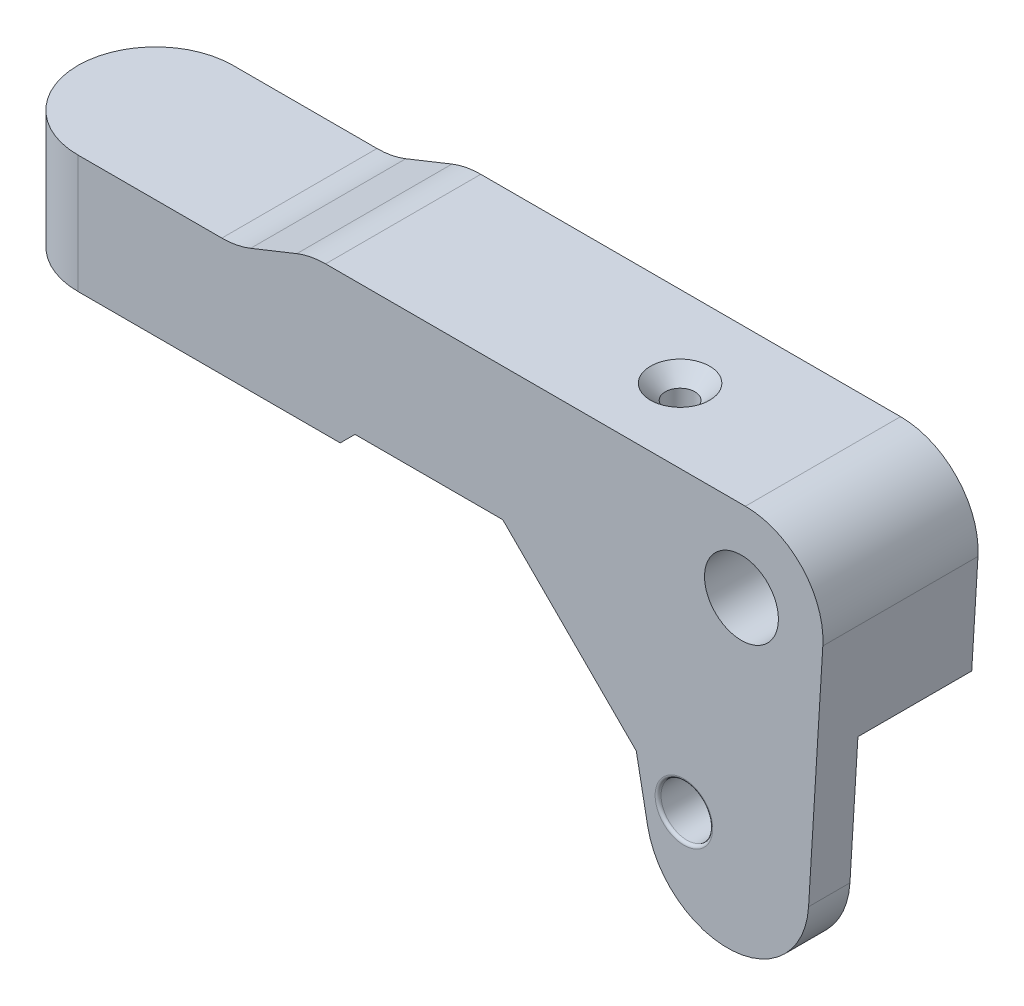
ISO-10303-21;
HEADER;
FILE_DESCRIPTION(('STEP AP214'),'2;1');
FILE_NAME('part.step','',(''),(''),'','','');
FILE_SCHEMA(('AUTOMOTIVE_DESIGN { 1 0 10303 214 1 1 1 1 }'));
ENDSEC;
DATA;
#1=APPLICATION_CONTEXT('core data for automotive mechanical design processes');
#2=APPLICATION_PROTOCOL_DEFINITION('international standard','automotive_design',2000,#1);
#3=PRODUCT_CONTEXT('',#1,'mechanical');
#4=PRODUCT('Part','Part','',(#3));
#5=PRODUCT_RELATED_PRODUCT_CATEGORY('part','',(#4));
#6=PRODUCT_DEFINITION_FORMATION('','',#4);
#7=PRODUCT_DEFINITION_CONTEXT('part definition',#1,'design');
#8=PRODUCT_DEFINITION('design','',#6,#7);
#9=PRODUCT_DEFINITION_SHAPE('','',#8);
#10=(LENGTH_UNIT() NAMED_UNIT(*) SI_UNIT(.MILLI.,.METRE.));
#11=(NAMED_UNIT(*) PLANE_ANGLE_UNIT() SI_UNIT($,.RADIAN.));
#12=(NAMED_UNIT(*) SI_UNIT($,.STERADIAN.) SOLID_ANGLE_UNIT());
#13=UNCERTAINTY_MEASURE_WITH_UNIT(LENGTH_MEASURE(1.E-05),#10,'distance_accuracy_value','');
#14=(GEOMETRIC_REPRESENTATION_CONTEXT(3) GLOBAL_UNCERTAINTY_ASSIGNED_CONTEXT((#13)) GLOBAL_UNIT_ASSIGNED_CONTEXT((#10,
#11,#12)) REPRESENTATION_CONTEXT('',''));
#15=CARTESIAN_POINT('',(0.,0.,0.));
#16=DIRECTION('',(0.,0.,1.));
#17=DIRECTION('',(1.,0.,0.));
#18=AXIS2_PLACEMENT_3D('',#15,#16,#17);
#19=CARTESIAN_POINT('',(-13.6533278103634,15.5,-6.8));
#20=DIRECTION('',(0.,0.,-1.));
#21=DIRECTION('',(1.,0.,0.));
#22=AXIS2_PLACEMENT_3D('',#19,#20,#21);
#23=PLANE('',#22);
#24=DIRECTION('',(-1.,0.,0.));
#25=VECTOR('',#24,1.);
#26=CARTESIAN_POINT('',(41.5821394377555,29.5,-6.8));
#27=LINE('',#26,#25);
#28=CARTESIAN_POINT('',(41.5821394377555,29.5,-6.8));
#29=VERTEX_POINT('',#28);
#30=CARTESIAN_POINT('',(32.66434643924,29.5,-6.8));
#31=VERTEX_POINT('',#30);
#32=EDGE_CURVE('E174',#29,#31,#27,.T.);
#33=ORIENTED_EDGE('',*,*,#32,.F.);
#34=DIRECTION('',(0.0610485395348604,0.998134798421867,0.));
#35=VECTOR('',#34,1.);
#36=CARTESIAN_POINT('',(41.0417207789877,20.6642330325583,-6.8));
#37=LINE('',#36,#35);
#38=CARTESIAN_POINT('',(41.0417207789877,20.6642330325583,-6.8));
#39=VERTEX_POINT('',#38);
#40=EDGE_CURVE('E184',#39,#29,#37,.T.);
#41=ORIENTED_EDGE('',*,*,#40,.F.);
#42=CARTESIAN_POINT('',(35.5519793876674,21.,-6.8));
#43=DIRECTION('',(0.,0.,1.));
#44=DIRECTION('',(1.,0.,0.));
#45=AXIS2_PLACEMENT_3D('',#42,#43,#44);
#46=CIRCLE('',#45,5.5);
#47=CARTESIAN_POINT('',(30.1505026967693,19.9636363776724,-6.8));
#48=VERTEX_POINT('',#47);
#49=EDGE_CURVE('E274',#48,#39,#46,.T.);
#50=ORIENTED_EDGE('',*,*,#49,.F.);
#51=DIRECTION('',(0.188429749514115,-0.98208667107239,0.));
#52=VECTOR('',#51,1.);
#53=CARTESIAN_POINT('',(29.3830358119642,23.9636363776724,-6.8));
#54=LINE('',#53,#52);
#55=CARTESIAN_POINT('',(29.3830358119642,23.9636363776724,-6.8));
#56=VERTEX_POINT('',#55);
#57=EDGE_CURVE('E213',#56,#48,#54,.T.);
#58=ORIENTED_EDGE('',*,*,#57,.F.);
#59=DIRECTION('',(0.707106781186546,-0.707106781186549,0.));
#60=VECTOR('',#59,1.);
#61=CARTESIAN_POINT('',(20.3466721896366,33.,-6.8));
#62=LINE('',#61,#60);
#63=CARTESIAN_POINT('',(24.8466721896366,28.5,-6.8));
#64=VERTEX_POINT('',#63);
#65=EDGE_CURVE('E192',#64,#56,#62,.T.);
#66=ORIENTED_EDGE('',*,*,#65,.F.);
#67=DIRECTION('',(-1.,0.,0.));
#68=VECTOR('',#67,1.);
#69=CARTESIAN_POINT('',(29.5821394377555,28.5,-6.8));
#70=LINE('',#69,#68);
#71=CARTESIAN_POINT('',(29.5821394377555,28.5,-6.8));
#72=VERTEX_POINT('',#71);
#73=EDGE_CURVE('E181',#72,#64,#70,.T.);
#74=ORIENTED_EDGE('',*,*,#73,.F.);
#75=CARTESIAN_POINT('',(32.66434643924,24.25,-6.8));
#76=DIRECTION('',(0.,0.,1.));
#77=DIRECTION('',(1.,0.,0.));
#78=AXIS2_PLACEMENT_3D('',#75,#76,#77);
#79=CIRCLE('',#78,5.25);
#80=EDGE_CURVE('E198',#31,#72,#79,.T.);
#81=ORIENTED_EDGE('',*,*,#80,.F.);
#82=EDGE_LOOP('',(#33,#41,#50,#58,#66,#74,#81));
#83=FACE_BOUND('',#82,.T.);
#84=CARTESIAN_POINT('',(32.6075359466494,22.,-6.8));
#85=DIRECTION('',(0.,0.,1.));
#86=DIRECTION('',(1.,0.,0.));
#87=AXIS2_PLACEMENT_3D('',#84,#85,#86);
#88=CIRCLE('',#87,2.5);
#89=CARTESIAN_POINT('',(35.1075359466494,22.,-6.8));
#90=VERTEX_POINT('',#89);
#91=EDGE_CURVE('E331',#90,#90,#88,.T.);
#92=ORIENTED_EDGE('',*,*,#91,.T.);
#93=EDGE_LOOP('',(#92));
#94=FACE_BOUND('',#93,.T.);
#95=ADVANCED_FACE('F35',(#83,#94),#23,.T.);
#96=CARTESIAN_POINT('',(29.3830358119642,23.9636363776724,-14.5));
#97=DIRECTION('',(0.982086671072389,0.188429749514115,0.));
#98=DIRECTION('',(-0.188429749514115,0.98208667107239,0.));
#99=AXIS2_PLACEMENT_3D('',#96,#97,#98);
#100=PLANE('',#99);
#101=ORIENTED_EDGE('',*,*,#57,.T.);
#102=DIRECTION('',(0.,0.,1.));
#103=VECTOR('',#102,1.);
#104=CARTESIAN_POINT('',(30.1505026967693,19.9636363776724,-14.5));
#105=LINE('',#104,#103);
#106=CARTESIAN_POINT('',(30.1505026967693,19.9636363776724,-4.));
#107=VERTEX_POINT('',#106);
#108=EDGE_CURVE('E265',#48,#107,#105,.T.);
#109=ORIENTED_EDGE('',*,*,#108,.T.);
#110=DIRECTION('',(0.188429749514115,-0.98208667107239,0.));
#111=VECTOR('',#110,1.);
#112=CARTESIAN_POINT('',(29.3830358119642,23.9636363776724,-4.));
#113=LINE('',#112,#111);
#114=CARTESIAN_POINT('',(29.3830358119642,23.9636363776724,-4.));
#115=VERTEX_POINT('',#114);
#116=EDGE_CURVE('E259',#115,#107,#113,.T.);
#117=ORIENTED_EDGE('',*,*,#116,.F.);
#118=DIRECTION('',(0.,0.,1.));
#119=VECTOR('',#118,1.);
#120=CARTESIAN_POINT('',(29.3830358119642,23.9636363776724,-14.5));
#121=LINE('',#120,#119);
#122=EDGE_CURVE('E268',#56,#115,#121,.T.);
#123=ORIENTED_EDGE('',*,*,#122,.F.);
#124=EDGE_LOOP('',(#101,#109,#117,#123));
#125=FACE_BOUND('',#124,.T.);
#126=ADVANCED_FACE('F408',(#125),#100,.F.);
#127=CARTESIAN_POINT('',(35.5519793876674,21.,-14.5));
#128=DIRECTION('',(0.,0.,1.));
#129=DIRECTION('',(-1.,0.,0.));
#130=AXIS2_PLACEMENT_3D('',#127,#128,#129);
#131=CYLINDRICAL_SURFACE('',#130,5.5);
#132=ORIENTED_EDGE('',*,*,#49,.T.);
#133=DIRECTION('',(0.,0.,1.));
#134=VECTOR('',#133,1.);
#135=CARTESIAN_POINT('',(41.0417207789877,20.6642330325583,-14.5));
#136=LINE('',#135,#134);
#137=CARTESIAN_POINT('',(41.0417207789877,20.6642330325583,-4.));
#138=VERTEX_POINT('',#137);
#139=EDGE_CURVE('E187',#39,#138,#136,.T.);
#140=ORIENTED_EDGE('',*,*,#139,.T.);
#141=CARTESIAN_POINT('',(35.5519793876674,21.,-4.));
#142=DIRECTION('',(0.,0.,1.));
#143=DIRECTION('',(1.,0.,0.));
#144=AXIS2_PLACEMENT_3D('',#141,#142,#143);
#145=CIRCLE('',#144,5.5);
#146=EDGE_CURVE('E222',#107,#138,#145,.T.);
#147=ORIENTED_EDGE('',*,*,#146,.F.);
#148=ORIENTED_EDGE('',*,*,#108,.F.);
#149=EDGE_LOOP('',(#132,#140,#147,#148));
#150=FACE_BOUND('',#149,.T.);
#151=ADVANCED_FACE('F413',(#150),#131,.T.);
#152=CARTESIAN_POINT('',(41.0417207789877,20.6642330325583,-14.5));
#153=DIRECTION('',(-0.998134798421867,0.0610485395348604,0.));
#154=DIRECTION('',(-0.0610485395348604,-0.998134798421867,0.));
#155=AXIS2_PLACEMENT_3D('',#152,#153,#154);
#156=PLANE('',#155);
#157=DIRECTION('',(0.0610485395348604,0.998134798421867,0.));
#158=VECTOR('',#157,1.);
#159=CARTESIAN_POINT('',(41.0417207789877,20.6642330325583,-4.));
#160=LINE('',#159,#158);
#161=CARTESIAN_POINT('',(42.0059655185164,36.429495167442,-4.));
#162=VERTEX_POINT('',#161);
#163=EDGE_CURVE('E191',#138,#162,#160,.T.);
#164=ORIENTED_EDGE('',*,*,#163,.F.);
#165=ORIENTED_EDGE('',*,*,#139,.F.);
#166=ORIENTED_EDGE('',*,*,#40,.T.);
#167=DIRECTION('',(0.,0.,-1.));
#168=VECTOR('',#167,1.);
#169=CARTESIAN_POINT('',(41.5821394377555,29.5,-6.8));
#170=LINE('',#169,#168);
#171=CARTESIAN_POINT('',(41.5821394377555,29.5,-14.5));
#172=VERTEX_POINT('',#171);
#173=EDGE_CURVE('E170',#29,#172,#170,.T.);
#174=ORIENTED_EDGE('',*,*,#173,.T.);
#175=DIRECTION('',(0.0610485395348604,0.998134798421867,0.));
#176=VECTOR('',#175,1.);
#177=CARTESIAN_POINT('',(41.0417207789877,20.6642330325583,-14.5));
#178=LINE('',#177,#176);
#179=CARTESIAN_POINT('',(42.0059655185164,36.429495167442,-14.5));
#180=VERTEX_POINT('',#179);
#181=EDGE_CURVE('E219',#172,#180,#178,.T.);
#182=ORIENTED_EDGE('',*,*,#181,.T.);
#183=DIRECTION('',(0.,0.,1.));
#184=VECTOR('',#183,1.);
#185=CARTESIAN_POINT('',(42.0059655185164,36.429495167442,-14.5));
#186=LINE('',#185,#184);
#187=EDGE_CURVE('E312',#162,#180,#186,.F.);
#188=ORIENTED_EDGE('',*,*,#187,.F.);
#189=EDGE_LOOP('',(#164,#165,#166,#174,#182,#188));
#190=FACE_BOUND('',#189,.T.);
#191=ADVANCED_FACE('F185',(#190),#156,.F.);
#192=CARTESIAN_POINT('',(42.3466721896366,42.,-14.5));
#193=DIRECTION('',(0.,-1.,0.));
#194=DIRECTION('',(0.,0.,1.));
#195=AXIS2_PLACEMENT_3D('',#192,#193,#194);
#196=PLANE('',#195);
#197=CARTESIAN_POINT('',(27.3466721896366,42.,-9.));
#198=DIRECTION('',(0.,1.,0.));
#199=DIRECTION('',(0.,0.,1.));
#200=AXIS2_PLACEMENT_3D('',#197,#198,#199);
#201=CIRCLE('',#200,1.99999999999999);
#202=CARTESIAN_POINT('',(27.3466721896366,42.,-7.00000000000001));
#203=VERTEX_POINT('',#202);
#204=EDGE_CURVE('E342',#203,#203,#201,.T.);
#205=ORIENTED_EDGE('',*,*,#204,.F.);
#206=EDGE_LOOP('',(#205));
#207=FACE_BOUND('',#206,.T.);
#208=DIRECTION('',(-1.,0.,0.));
#209=VECTOR('',#208,1.);
#210=CARTESIAN_POINT('',(42.3466721896366,42.,-4.));
#211=LINE('',#210,#209);
#212=CARTESIAN_POINT('',(36.7657578268016,42.,-4.));
#213=VERTEX_POINT('',#212);
#214=CARTESIAN_POINT('',(8.3577298083647,42.,-4.));
#215=VERTEX_POINT('',#214);
#216=EDGE_CURVE('E242',#213,#215,#211,.T.);
#217=ORIENTED_EDGE('',*,*,#216,.F.);
#218=DIRECTION('',(0.,0.,1.));
#219=VECTOR('',#218,1.);
#220=CARTESIAN_POINT('',(36.7657578268016,42.,-14.5));
#221=LINE('',#220,#219);
#222=CARTESIAN_POINT('',(36.7657578268016,42.,-14.5));
#223=VERTEX_POINT('',#222);
#224=EDGE_CURVE('E297',#223,#213,#221,.T.);
#225=ORIENTED_EDGE('',*,*,#224,.F.);
#226=DIRECTION('',(-1.,0.,0.));
#227=VECTOR('',#226,1.);
#228=CARTESIAN_POINT('',(42.3466721896366,42.,-14.5));
#229=LINE('',#228,#227);
#230=CARTESIAN_POINT('',(8.3577298083647,42.,-14.5));
#231=VERTEX_POINT('',#230);
#232=EDGE_CURVE('E221',#223,#231,#229,.T.);
#233=ORIENTED_EDGE('',*,*,#232,.T.);
#234=DIRECTION('',(0.,0.,1.));
#235=VECTOR('',#234,1.);
#236=CARTESIAN_POINT('',(8.3577298083647,42.,-14.5));
#237=LINE('',#236,#235);
#238=EDGE_CURVE('E300',#215,#231,#237,.F.);
#239=ORIENTED_EDGE('',*,*,#238,.F.);
#240=EDGE_LOOP('',(#217,#225,#233,#239));
#241=FACE_BOUND('',#240,.T.);
#242=ADVANCED_FACE('F649',(#207,#241),#196,.F.);
#243=CARTESIAN_POINT('',(7.34667218963663,42.,-14.5));
#244=DIRECTION('',(0.371390676354103,-0.928476690885259,0.));
#245=DIRECTION('',(0.92847669088526,0.371390676354103,0.));
#246=AXIS2_PLACEMENT_3D('',#243,#244,#245);
#247=PLANE('',#246);
#248=DIRECTION('',(-0.92847669088526,-0.371390676354103,0.));
#249=VECTOR('',#248,1.);
#250=CARTESIAN_POINT('',(7.34667218963663,42.,-4.));
#251=LINE('',#250,#249);
#252=CARTESIAN_POINT('',(6.40792875750565,41.6245026271476,-4.));
#253=VERTEX_POINT('',#252);
#254=CARTESIAN_POINT('',(3.28541562176761,40.3754973728524,-4.));
#255=VERTEX_POINT('',#254);
#256=EDGE_CURVE('E245',#253,#255,#251,.T.);
#257=ORIENTED_EDGE('',*,*,#256,.F.);
#258=DIRECTION('',(0.,0.,1.));
#259=VECTOR('',#258,1.);
#260=CARTESIAN_POINT('',(6.40792875750565,41.6245026271476,-14.5));
#261=LINE('',#260,#259);
#262=CARTESIAN_POINT('',(6.40792875750565,41.6245026271476,-14.5));
#263=VERTEX_POINT('',#262);
#264=EDGE_CURVE('E285',#263,#253,#261,.T.);
#265=ORIENTED_EDGE('',*,*,#264,.F.);
#266=DIRECTION('',(-0.92847669088526,-0.371390676354103,0.));
#267=VECTOR('',#266,1.);
#268=CARTESIAN_POINT('',(7.34667218963663,42.,-14.5));
#269=LINE('',#268,#267);
#270=CARTESIAN_POINT('',(3.28541562176761,40.3754973728524,-14.5));
#271=VERTEX_POINT('',#270);
#272=EDGE_CURVE('E225',#263,#271,#269,.T.);
#273=ORIENTED_EDGE('',*,*,#272,.T.);
#274=DIRECTION('',(0.,0.,1.));
#275=VECTOR('',#274,1.);
#276=CARTESIAN_POINT('',(3.28541562176761,40.3754973728524,-14.5));
#277=LINE('',#276,#275);
#278=EDGE_CURVE('E288',#255,#271,#277,.F.);
#279=ORIENTED_EDGE('',*,*,#278,.F.);
#280=EDGE_LOOP('',(#257,#265,#273,#279));
#281=FACE_BOUND('',#280,.T.);
#282=ADVANCED_FACE('F645',(#281),#247,.F.);
#283=CARTESIAN_POINT('',(2.34667218963663,40.,-14.5));
#284=DIRECTION('',(0.,-1.,0.));
#285=DIRECTION('',(1.,0.,0.));
#286=AXIS2_PLACEMENT_3D('',#283,#284,#285);
#287=PLANE('',#286);
#288=DIRECTION('',(-1.,0.,0.));
#289=VECTOR('',#288,1.);
#290=CARTESIAN_POINT('',(2.34667218963663,40.,-14.5));
#291=LINE('',#290,#289);
#292=CARTESIAN_POINT('',(1.33561457090857,40.,-14.5));
#293=VERTEX_POINT('',#292);
#294=CARTESIAN_POINT('',(-8.40332781036337,40.,-14.5));
#295=VERTEX_POINT('',#294);
#296=EDGE_CURVE('E228',#293,#295,#291,.T.);
#297=ORIENTED_EDGE('',*,*,#296,.T.);
#298=CARTESIAN_POINT('',(-8.40332781036337,40.,-9.25));
#299=DIRECTION('',(0.,1.,0.));
#300=DIRECTION('',(1.,0.,0.));
#301=AXIS2_PLACEMENT_3D('',#298,#299,#300);
#302=CIRCLE('',#301,5.25);
#303=CARTESIAN_POINT('',(-13.6533278103634,40.,-9.25));
#304=VERTEX_POINT('',#303);
#305=EDGE_CURVE('E276',#304,#295,#302,.F.);
#306=ORIENTED_EDGE('',*,*,#305,.F.);
#307=CARTESIAN_POINT('',(-8.40332781036337,40.,-9.25));
#308=DIRECTION('',(0.,1.,0.));
#309=DIRECTION('',(1.,0.,0.));
#310=AXIS2_PLACEMENT_3D('',#307,#308,#309);
#311=CIRCLE('',#310,5.25);
#312=CARTESIAN_POINT('',(-8.40332781036337,40.,-4.));
#313=VERTEX_POINT('',#312);
#314=EDGE_CURVE('E279',#313,#304,#311,.F.);
#315=ORIENTED_EDGE('',*,*,#314,.F.);
#316=DIRECTION('',(-1.,0.,0.));
#317=VECTOR('',#316,1.);
#318=CARTESIAN_POINT('',(2.34667218963663,40.,-4.));
#319=LINE('',#318,#317);
#320=CARTESIAN_POINT('',(1.33561457090857,40.,-4.));
#321=VERTEX_POINT('',#320);
#322=EDGE_CURVE('E248',#321,#313,#319,.T.);
#323=ORIENTED_EDGE('',*,*,#322,.F.);
#324=DIRECTION('',(0.,0.,1.));
#325=VECTOR('',#324,1.);
#326=CARTESIAN_POINT('',(1.33561457090857,40.,-4.));
#327=LINE('',#326,#325);
#328=EDGE_CURVE('E282',#293,#321,#327,.T.);
#329=ORIENTED_EDGE('',*,*,#328,.F.);
#330=EDGE_LOOP('',(#297,#306,#315,#323,#329));
#331=FACE_BOUND('',#330,.T.);
#332=ADVANCED_FACE('F630',(#331),#287,.F.);
#333=CARTESIAN_POINT('',(-13.6533278103634,32.,-14.5));
#334=DIRECTION('',(0.,1.,0.));
#335=DIRECTION('',(0.,0.,-1.));
#336=AXIS2_PLACEMENT_3D('',#333,#334,#335);
#337=PLANE('',#336);
#338=CARTESIAN_POINT('',(6.59458871160727,32.,-9.5));
#339=DIRECTION('',(0.,-1.,0.));
#340=DIRECTION('',(0.,0.,-1.));
#341=AXIS2_PLACEMENT_3D('',#338,#339,#340);
#342=CIRCLE('',#341,1.45);
#343=CARTESIAN_POINT('',(6.59458871160727,32.,-10.95));
#344=VERTEX_POINT('',#343);
#345=EDGE_CURVE('E373',#344,#344,#342,.T.);
#346=ORIENTED_EDGE('',*,*,#345,.F.);
#347=EDGE_LOOP('',(#346));
#348=FACE_BOUND('',#347,.T.);
#349=CARTESIAN_POINT('',(-8.40332781036337,32.,-9.25));
#350=DIRECTION('',(0.,-1.,0.));
#351=DIRECTION('',(0.,0.,-1.));
#352=AXIS2_PLACEMENT_3D('',#349,#350,#351);
#353=CIRCLE('',#352,5.25);
#354=CARTESIAN_POINT('',(-8.40332781036337,32.,-14.5));
#355=VERTEX_POINT('',#354);
#356=CARTESIAN_POINT('',(-13.6533278103634,32.,-9.25));
#357=VERTEX_POINT('',#356);
#358=EDGE_CURVE('E315',#355,#357,#353,.F.);
#359=ORIENTED_EDGE('',*,*,#358,.F.);
#360=DIRECTION('',(1.,0.,0.));
#361=VECTOR('',#360,1.);
#362=CARTESIAN_POINT('',(-13.6533278103634,32.,-14.5));
#363=LINE('',#362,#361);
#364=CARTESIAN_POINT('',(9.34667218963663,32.,-14.5));
#365=VERTEX_POINT('',#364);
#366=EDGE_CURVE('E231',#355,#365,#363,.T.);
#367=ORIENTED_EDGE('',*,*,#366,.T.);
#368=DIRECTION('',(0.,0.,1.));
#369=VECTOR('',#368,1.);
#370=CARTESIAN_POINT('',(9.34667218963663,32.,-14.5));
#371=LINE('',#370,#369);
#372=CARTESIAN_POINT('',(9.34667218963663,32.,-4.));
#373=VERTEX_POINT('',#372);
#374=EDGE_CURVE('E271',#365,#373,#371,.T.);
#375=ORIENTED_EDGE('',*,*,#374,.T.);
#376=DIRECTION('',(1.,0.,0.));
#377=VECTOR('',#376,1.);
#378=CARTESIAN_POINT('',(-13.6533278103634,32.,-4.));
#379=LINE('',#378,#377);
#380=CARTESIAN_POINT('',(-8.40332781036336,32.,-4.));
#381=VERTEX_POINT('',#380);
#382=EDGE_CURVE('E251',#381,#373,#379,.T.);
#383=ORIENTED_EDGE('',*,*,#382,.F.);
#384=CARTESIAN_POINT('',(-8.40332781036336,32.,-9.25));
#385=DIRECTION('',(0.,-1.,0.));
#386=DIRECTION('',(0.,0.,-1.));
#387=AXIS2_PLACEMENT_3D('',#384,#385,#386);
#388=CIRCLE('',#387,5.25);
#389=EDGE_CURVE('E318',#357,#381,#388,.F.);
#390=ORIENTED_EDGE('',*,*,#389,.F.);
#391=EDGE_LOOP('',(#359,#367,#375,#383,#390));
#392=FACE_BOUND('',#391,.T.);
#393=ADVANCED_FACE('F627',(#348,#392),#337,.F.);
#394=CARTESIAN_POINT('',(9.34667218963663,33.,-14.5));
#395=DIRECTION('',(0.,1.,0.));
#396=DIRECTION('',(0.,0.,-1.));
#397=AXIS2_PLACEMENT_3D('',#394,#395,#396);
#398=PLANE('',#397);
#399=DIRECTION('',(1.,0.,0.));
#400=VECTOR('',#399,1.);
#401=CARTESIAN_POINT('',(9.34667218963663,33.,-4.));
#402=LINE('',#401,#400);
#403=CARTESIAN_POINT('',(10.3466721896366,33.,-4.));
#404=VERTEX_POINT('',#403);
#405=CARTESIAN_POINT('',(20.263829477162,33.,-4.));
#406=VERTEX_POINT('',#405);
#407=EDGE_CURVE('E254',#404,#406,#402,.T.);
#408=ORIENTED_EDGE('',*,*,#407,.F.);
#409=DIRECTION('',(0.,0.,1.));
#410=VECTOR('',#409,1.);
#411=CARTESIAN_POINT('',(10.3466721896366,33.,-4.));
#412=LINE('',#411,#410);
#413=CARTESIAN_POINT('',(10.3466721896366,33.,-14.5));
#414=VERTEX_POINT('',#413);
#415=EDGE_CURVE('E328',#414,#404,#412,.T.);
#416=ORIENTED_EDGE('',*,*,#415,.F.);
#417=DIRECTION('',(1.,0.,0.));
#418=VECTOR('',#417,1.);
#419=CARTESIAN_POINT('',(9.34667218963663,33.,-14.5));
#420=LINE('',#419,#418);
#421=CARTESIAN_POINT('',(20.263829477162,33.,-14.5));
#422=VERTEX_POINT('',#421);
#423=EDGE_CURVE('E234',#414,#422,#420,.T.);
#424=ORIENTED_EDGE('',*,*,#423,.T.);
#425=DIRECTION('',(0.,0.,1.));
#426=VECTOR('',#425,1.);
#427=CARTESIAN_POINT('',(20.263829477162,33.,-14.5));
#428=LINE('',#427,#426);
#429=EDGE_CURVE('E362',#406,#422,#428,.F.);
#430=ORIENTED_EDGE('',*,*,#429,.F.);
#431=EDGE_LOOP('',(#408,#416,#424,#430));
#432=FACE_BOUND('',#431,.T.);
#433=ADVANCED_FACE('F381',(#432),#398,.F.);
#434=CARTESIAN_POINT('',(20.3466721896366,33.,-14.5));
#435=DIRECTION('',(0.707106781186549,0.707106781186546,0.));
#436=DIRECTION('',(-0.707106781186546,0.707106781186549,0.));
#437=AXIS2_PLACEMENT_3D('',#434,#435,#436);
#438=PLANE('',#437);
#439=DIRECTION('',(0.707106781186546,-0.707106781186549,0.));
#440=VECTOR('',#439,1.);
#441=CARTESIAN_POINT('',(20.3466721896366,33.,-14.5));
#442=LINE('',#441,#440);
#443=CARTESIAN_POINT('',(20.4052508333993,32.9414213562373,-14.5));
#444=VERTEX_POINT('',#443);
#445=CARTESIAN_POINT('',(24.8466721896366,28.5,-14.5));
#446=VERTEX_POINT('',#445);
#447=EDGE_CURVE('E237',#444,#446,#442,.T.);
#448=ORIENTED_EDGE('',*,*,#447,.T.);
#449=DIRECTION('',(0.,0.,-1.));
#450=VECTOR('',#449,1.);
#451=CARTESIAN_POINT('',(24.8466721896366,28.5,-6.8));
#452=LINE('',#451,#450);
#453=EDGE_CURVE('E210',#64,#446,#452,.T.);
#454=ORIENTED_EDGE('',*,*,#453,.F.);
#455=ORIENTED_EDGE('',*,*,#65,.T.);
#456=ORIENTED_EDGE('',*,*,#122,.T.);
#457=DIRECTION('',(0.707106781186546,-0.707106781186549,0.));
#458=VECTOR('',#457,1.);
#459=CARTESIAN_POINT('',(20.3466721896366,33.,-4.));
#460=LINE('',#459,#458);
#461=CARTESIAN_POINT('',(20.4052508333993,32.9414213562373,-4.));
#462=VERTEX_POINT('',#461);
#463=EDGE_CURVE('E257',#462,#115,#460,.T.);
#464=ORIENTED_EDGE('',*,*,#463,.F.);
#465=DIRECTION('',(0.,0.,1.));
#466=VECTOR('',#465,1.);
#467=CARTESIAN_POINT('',(20.4052508333993,32.9414213562373,-4.));
#468=LINE('',#467,#466);
#469=EDGE_CURVE('E360',#444,#462,#468,.T.);
#470=ORIENTED_EDGE('',*,*,#469,.F.);
#471=EDGE_LOOP('',(#448,#454,#455,#456,#464,#470));
#472=FACE_BOUND('',#471,.T.);
#473=ADVANCED_FACE('F393',(#472),#438,.F.);
#474=CARTESIAN_POINT('',(35.5519793876674,21.,-14.5));
#475=DIRECTION('',(0.,0.,-1.));
#476=DIRECTION('',(1.,0.,0.));
#477=AXIS2_PLACEMENT_3D('',#474,#475,#476);
#478=PLANE('',#477);
#479=CARTESIAN_POINT('',(36.5,36.5,-14.5));
#480=DIRECTION('',(0.,0.,1.));
#481=DIRECTION('',(1.,0.,0.));
#482=AXIS2_PLACEMENT_3D('',#479,#480,#481);
#483=CIRCLE('',#482,4.00000000000001);
#484=CARTESIAN_POINT('',(40.5,36.5,-14.5));
#485=VERTEX_POINT('',#484);
#486=EDGE_CURVE('E205',#485,#485,#483,.T.);
#487=ORIENTED_EDGE('',*,*,#486,.T.);
#488=EDGE_LOOP('',(#487));
#489=FACE_BOUND('',#488,.T.);
#490=ORIENTED_EDGE('',*,*,#232,.F.);
#491=CARTESIAN_POINT('',(36.7657578268016,36.75,-14.5));
#492=DIRECTION('',(0.,0.,1.));
#493=DIRECTION('',(1.,0.,0.));
#494=AXIS2_PLACEMENT_3D('',#491,#492,#493);
#495=CIRCLE('',#494,5.25);
#496=EDGE_CURVE('E305',#180,#223,#495,.T.);
#497=ORIENTED_EDGE('',*,*,#496,.F.);
#498=ORIENTED_EDGE('',*,*,#181,.F.);
#499=DIRECTION('',(-1.,0.,0.));
#500=VECTOR('',#499,1.);
#501=CARTESIAN_POINT('',(41.5821394377555,29.5,-14.5));
#502=LINE('',#501,#500);
#503=CARTESIAN_POINT('',(32.66434643924,29.5,-14.5));
#504=VERTEX_POINT('',#503);
#505=EDGE_CURVE('E176',#172,#504,#502,.T.);
#506=ORIENTED_EDGE('',*,*,#505,.T.);
#507=CARTESIAN_POINT('',(32.66434643924,24.25,-14.5));
#508=DIRECTION('',(0.,0.,1.));
#509=DIRECTION('',(1.,0.,0.));
#510=AXIS2_PLACEMENT_3D('',#507,#508,#509);
#511=CIRCLE('',#510,5.25);
#512=CARTESIAN_POINT('',(29.5821394377555,28.5,-14.5));
#513=VERTEX_POINT('',#512);
#514=EDGE_CURVE('E325',#513,#504,#511,.F.);
#515=ORIENTED_EDGE('',*,*,#514,.F.);
#516=DIRECTION('',(-1.,0.,0.));
#517=VECTOR('',#516,1.);
#518=CARTESIAN_POINT('',(29.5821394377555,28.5,-14.5));
#519=LINE('',#518,#517);
#520=EDGE_CURVE('E199',#513,#446,#519,.T.);
#521=ORIENTED_EDGE('',*,*,#520,.T.);
#522=ORIENTED_EDGE('',*,*,#447,.F.);
#523=CARTESIAN_POINT('',(20.263829477162,32.8,-14.5));
#524=DIRECTION('',(0.,0.,1.));
#525=DIRECTION('',(1.,0.,0.));
#526=AXIS2_PLACEMENT_3D('',#523,#524,#525);
#527=CIRCLE('',#526,0.2);
#528=EDGE_CURVE('E11',#422,#444,#527,.F.);
#529=ORIENTED_EDGE('',*,*,#528,.F.);
#530=ORIENTED_EDGE('',*,*,#423,.F.);
#531=DIRECTION('',(-0.707106781186552,-0.707106781186543,0.));
#532=VECTOR('',#531,1.);
#533=CARTESIAN_POINT('',(10.3466721896366,33.,-14.5));
#534=LINE('',#533,#532);
#535=EDGE_CURVE('E337',#365,#414,#534,.F.);
#536=ORIENTED_EDGE('',*,*,#535,.F.);
#537=ORIENTED_EDGE('',*,*,#366,.F.);
#538=DIRECTION('',(0.,-1.,0.));
#539=VECTOR('',#538,1.);
#540=CARTESIAN_POINT('',(-8.40332781036337,32.,-14.5));
#541=LINE('',#540,#539);
#542=EDGE_CURVE('E303',#295,#355,#541,.T.);
#543=ORIENTED_EDGE('',*,*,#542,.F.);
#544=ORIENTED_EDGE('',*,*,#296,.F.);
#545=CARTESIAN_POINT('',(1.33561457090857,45.25,-14.5));
#546=DIRECTION('',(0.,0.,1.));
#547=DIRECTION('',(1.,0.,0.));
#548=AXIS2_PLACEMENT_3D('',#545,#546,#547);
#549=CIRCLE('',#548,5.25);
#550=EDGE_CURVE('E323',#271,#293,#549,.F.);
#551=ORIENTED_EDGE('',*,*,#550,.F.);
#552=ORIENTED_EDGE('',*,*,#272,.F.);
#553=CARTESIAN_POINT('',(8.35772980836469,36.75,-14.5));
#554=DIRECTION('',(0.,0.,1.));
#555=DIRECTION('',(1.,0.,0.));
#556=AXIS2_PLACEMENT_3D('',#553,#554,#555);
#557=CIRCLE('',#556,5.25);
#558=EDGE_CURVE('E307',#231,#263,#557,.T.);
#559=ORIENTED_EDGE('',*,*,#558,.F.);
#560=EDGE_LOOP('',(#490,#497,#498,#506,#515,#521,#522,#529,#530,#536,#537,#543,#544,#551,#552,#559));
#561=FACE_BOUND('',#560,.T.);
#562=ADVANCED_FACE('F390',(#489,#561),#478,.T.);
#563=CARTESIAN_POINT('',(35.5519793876674,21.,-4.));
#564=DIRECTION('',(0.,0.,-1.));
#565=DIRECTION('',(1.,0.,0.));
#566=AXIS2_PLACEMENT_3D('',#563,#564,#565);
#567=PLANE('',#566);
#568=CARTESIAN_POINT('',(32.6075359466494,22.,-4.));
#569=DIRECTION('',(0.,0.,1.));
#570=DIRECTION('',(1.,0.,0.));
#571=AXIS2_PLACEMENT_3D('',#568,#569,#570);
#572=CIRCLE('',#571,1.95);
#573=CARTESIAN_POINT('',(34.5575359466494,22.,-4.));
#574=VERTEX_POINT('',#573);
#575=EDGE_CURVE('E357',#574,#574,#572,.T.);
#576=ORIENTED_EDGE('',*,*,#575,.F.);
#577=EDGE_LOOP('',(#576));
#578=FACE_BOUND('',#577,.T.);
#579=CARTESIAN_POINT('',(36.5,36.5,-4.));
#580=DIRECTION('',(0.,0.,1.));
#581=DIRECTION('',(1.,0.,0.));
#582=AXIS2_PLACEMENT_3D('',#579,#580,#581);
#583=CIRCLE('',#582,2.5);
#584=CARTESIAN_POINT('',(39.,36.5,-4.));
#585=VERTEX_POINT('',#584);
#586=EDGE_CURVE('E437',#585,#585,#583,.T.);
#587=ORIENTED_EDGE('',*,*,#586,.F.);
#588=EDGE_LOOP('',(#587));
#589=FACE_BOUND('',#588,.T.);
#590=ORIENTED_EDGE('',*,*,#256,.T.);
#591=CARTESIAN_POINT('',(1.33561457090857,45.25,-4.));
#592=DIRECTION('',(0.,0.,1.));
#593=DIRECTION('',(1.,0.,0.));
#594=AXIS2_PLACEMENT_3D('',#591,#592,#593);
#595=CIRCLE('',#594,5.25);
#596=EDGE_CURVE('E321',#321,#255,#595,.T.);
#597=ORIENTED_EDGE('',*,*,#596,.F.);
#598=ORIENTED_EDGE('',*,*,#322,.T.);
#599=DIRECTION('',(0.,-1.,0.));
#600=VECTOR('',#599,1.);
#601=CARTESIAN_POINT('',(-8.40332781036337,21.,-4.));
#602=LINE('',#601,#600);
#603=EDGE_CURVE('E291',#381,#313,#602,.F.);
#604=ORIENTED_EDGE('',*,*,#603,.F.);
#605=ORIENTED_EDGE('',*,*,#382,.T.);
#606=DIRECTION('',(0.707106781186552,0.707106781186543,0.));
#607=VECTOR('',#606,1.);
#608=CARTESIAN_POINT('',(16.9493257886522,39.6026535990155,-4.));
#609=LINE('',#608,#607);
#610=EDGE_CURVE('E335',#404,#373,#609,.F.);
#611=ORIENTED_EDGE('',*,*,#610,.F.);
#612=ORIENTED_EDGE('',*,*,#407,.T.);
#613=CARTESIAN_POINT('',(20.263829477162,32.8,-4.));
#614=DIRECTION('',(0.,0.,1.));
#615=DIRECTION('',(1.,0.,0.));
#616=AXIS2_PLACEMENT_3D('',#613,#614,#615);
#617=CIRCLE('',#616,0.2);
#618=EDGE_CURVE('E43',#462,#406,#617,.T.);
#619=ORIENTED_EDGE('',*,*,#618,.F.);
#620=ORIENTED_EDGE('',*,*,#463,.T.);
#621=ORIENTED_EDGE('',*,*,#116,.T.);
#622=ORIENTED_EDGE('',*,*,#146,.T.);
#623=ORIENTED_EDGE('',*,*,#163,.T.);
#624=CARTESIAN_POINT('',(36.7657578268016,36.75,-4.));
#625=DIRECTION('',(0.,0.,1.));
#626=DIRECTION('',(1.,0.,0.));
#627=AXIS2_PLACEMENT_3D('',#624,#625,#626);
#628=CIRCLE('',#627,5.25);
#629=EDGE_CURVE('E293',#213,#162,#628,.F.);
#630=ORIENTED_EDGE('',*,*,#629,.F.);
#631=ORIENTED_EDGE('',*,*,#216,.T.);
#632=CARTESIAN_POINT('',(8.35772980836469,36.75,-4.));
#633=DIRECTION('',(0.,0.,1.));
#634=DIRECTION('',(1.,0.,0.));
#635=AXIS2_PLACEMENT_3D('',#632,#633,#634);
#636=CIRCLE('',#635,5.25);
#637=EDGE_CURVE('E295',#253,#215,#636,.F.);
#638=ORIENTED_EDGE('',*,*,#637,.F.);
#639=EDGE_LOOP('',(#590,#597,#598,#604,#605,#611,#612,#619,#620,#621,#622,#623,#630,#631,#638));
#640=FACE_BOUND('',#639,.T.);
#641=ADVANCED_FACE('F383',(#578,#589,#640),#567,.F.);
#642=CARTESIAN_POINT('',(29.5821394377555,28.5,-6.8));
#643=DIRECTION('',(0.,1.,0.));
#644=DIRECTION('',(0.,0.,-1.));
#645=AXIS2_PLACEMENT_3D('',#642,#643,#644);
#646=PLANE('',#645);
#647=CARTESIAN_POINT('',(27.3466721896366,28.5,-9.));
#648=DIRECTION('',(0.,-1.,0.));
#649=DIRECTION('',(0.,0.,-1.));
#650=AXIS2_PLACEMENT_3D('',#647,#648,#649);
#651=CIRCLE('',#650,1.2);
#652=CARTESIAN_POINT('',(27.3466721896366,28.5,-10.2));
#653=VERTEX_POINT('',#652);
#654=EDGE_CURVE('E364',#653,#653,#651,.T.);
#655=ORIENTED_EDGE('',*,*,#654,.F.);
#656=EDGE_LOOP('',(#655));
#657=FACE_BOUND('',#656,.T.);
#658=ORIENTED_EDGE('',*,*,#520,.F.);
#659=DIRECTION('',(0.,0.,-1.));
#660=VECTOR('',#659,1.);
#661=CARTESIAN_POINT('',(29.5821394377555,28.5,-6.8));
#662=LINE('',#661,#660);
#663=EDGE_CURVE('E180',#72,#513,#662,.T.);
#664=ORIENTED_EDGE('',*,*,#663,.F.);
#665=ORIENTED_EDGE('',*,*,#73,.T.);
#666=ORIENTED_EDGE('',*,*,#453,.T.);
#667=EDGE_LOOP('',(#658,#664,#665,#666));
#668=FACE_BOUND('',#667,.T.);
#669=ADVANCED_FACE('F400',(#657,#668),#646,.F.);
#670=CARTESIAN_POINT('',(41.5821394377555,29.5,-6.8));
#671=DIRECTION('',(0.,1.,0.));
#672=DIRECTION('',(-1.,0.,0.));
#673=AXIS2_PLACEMENT_3D('',#670,#671,#672);
#674=PLANE('',#673);
#675=ORIENTED_EDGE('',*,*,#505,.F.);
#676=ORIENTED_EDGE('',*,*,#173,.F.);
#677=ORIENTED_EDGE('',*,*,#32,.T.);
#678=DIRECTION('',(0.,0.,1.));
#679=VECTOR('',#678,1.);
#680=CARTESIAN_POINT('',(32.66434643924,29.5,-6.8));
#681=LINE('',#680,#679);
#682=EDGE_CURVE('E309',#504,#31,#681,.T.);
#683=ORIENTED_EDGE('',*,*,#682,.F.);
#684=EDGE_LOOP('',(#675,#676,#677,#683));
#685=FACE_BOUND('',#684,.T.);
#686=ADVANCED_FACE('F172',(#685),#674,.F.);
#687=CARTESIAN_POINT('',(36.5,36.5,-10.5));
#688=DIRECTION('',(0.,0.,-1.));
#689=DIRECTION('',(1.,0.,0.));
#690=AXIS2_PLACEMENT_3D('',#687,#688,#689);
#691=CYLINDRICAL_SURFACE('',#690,4.00000000000001);
#692=CARTESIAN_POINT('',(36.5,36.5,-10.5));
#693=DIRECTION('',(0.,0.,1.));
#694=DIRECTION('',(1.,0.,0.));
#695=AXIS2_PLACEMENT_3D('',#692,#693,#694);
#696=CIRCLE('',#695,4.00000000000001);
#697=CARTESIAN_POINT('',(40.5,36.5,-10.5));
#698=VERTEX_POINT('',#697);
#699=EDGE_CURVE('E208',#698,#698,#696,.T.);
#700=ORIENTED_EDGE('',*,*,#699,.T.);
#701=EDGE_LOOP('',(#700));
#702=FACE_BOUND('',#701,.T.);
#703=ORIENTED_EDGE('',*,*,#486,.F.);
#704=EDGE_LOOP('',(#703));
#705=FACE_BOUND('',#704,.T.);
#706=ADVANCED_FACE('F418',(#702,#705),#691,.F.);
#707=CARTESIAN_POINT('',(36.5,36.5,-10.5));
#708=DIRECTION('',(0.,0.,-1.));
#709=DIRECTION('',(1.,0.,0.));
#710=AXIS2_PLACEMENT_3D('',#707,#708,#709);
#711=PLANE('',#710);
#712=CARTESIAN_POINT('',(36.5,36.5,-10.5));
#713=DIRECTION('',(0.,0.,1.));
#714=DIRECTION('',(1.,0.,0.));
#715=AXIS2_PLACEMENT_3D('',#712,#713,#714);
#716=CIRCLE('',#715,2.5);
#717=CARTESIAN_POINT('',(39.,36.5,-10.5));
#718=VERTEX_POINT('',#717);
#719=EDGE_CURVE('E439',#718,#718,#716,.T.);
#720=ORIENTED_EDGE('',*,*,#719,.T.);
#721=EDGE_LOOP('',(#720));
#722=FACE_BOUND('',#721,.T.);
#723=ORIENTED_EDGE('',*,*,#699,.F.);
#724=EDGE_LOOP('',(#723));
#725=FACE_BOUND('',#724,.T.);
#726=ADVANCED_FACE('F426',(#722,#725),#711,.T.);
#727=CARTESIAN_POINT('',(36.5,36.5,-4.));
#728=DIRECTION('',(0.,0.,-1.));
#729=DIRECTION('',(1.,0.,0.));
#730=AXIS2_PLACEMENT_3D('',#727,#728,#729);
#731=CYLINDRICAL_SURFACE('',#730,2.5);
#732=ORIENTED_EDGE('',*,*,#586,.T.);
#733=EDGE_LOOP('',(#732));
#734=FACE_BOUND('',#733,.T.);
#735=ORIENTED_EDGE('',*,*,#719,.F.);
#736=EDGE_LOOP('',(#735));
#737=FACE_BOUND('',#736,.T.);
#738=ADVANCED_FACE('F431',(#734,#737),#731,.F.);
#739=CARTESIAN_POINT('',(32.6075359466494,22.,-4.));
#740=DIRECTION('',(0.,0.,-1.));
#741=DIRECTION('',(1.,0.,0.));
#742=AXIS2_PLACEMENT_3D('',#739,#740,#741);
#743=CYLINDRICAL_SURFACE('',#742,1.75);
#744=CARTESIAN_POINT('',(32.6075359466494,22.,-6.8));
#745=DIRECTION('',(0.,0.,1.));
#746=DIRECTION('',(1.,0.,0.));
#747=AXIS2_PLACEMENT_3D('',#744,#745,#746);
#748=CIRCLE('',#747,1.75);
#749=CARTESIAN_POINT('',(34.3575359466494,22.,-6.8));
#750=VERTEX_POINT('',#749);
#751=EDGE_CURVE('E348',#750,#750,#748,.T.);
#752=ORIENTED_EDGE('',*,*,#751,.F.);
#753=EDGE_LOOP('',(#752));
#754=FACE_BOUND('',#753,.T.);
#755=CARTESIAN_POINT('',(32.6075359466494,22.,-4.2));
#756=DIRECTION('',(0.,0.,1.));
#757=DIRECTION('',(1.,0.,0.));
#758=AXIS2_PLACEMENT_3D('',#755,#756,#757);
#759=CIRCLE('',#758,1.75);
#760=CARTESIAN_POINT('',(34.3575359466494,22.,-4.2));
#761=VERTEX_POINT('',#760);
#762=EDGE_CURVE('E345',#761,#761,#759,.F.);
#763=ORIENTED_EDGE('',*,*,#762,.F.);
#764=EDGE_LOOP('',(#763));
#765=FACE_BOUND('',#764,.T.);
#766=ADVANCED_FACE('F476',(#754,#765),#743,.F.);
#767=CARTESIAN_POINT('',(32.6075359466494,22.,-7.));
#768=DIRECTION('',(0.,0.,-1.));
#769=DIRECTION('',(1.,0.,0.));
#770=AXIS2_PLACEMENT_3D('',#767,#768,#769);
#771=PLANE('',#770);
#772=CARTESIAN_POINT('',(32.6075359466494,22.,-7.));
#773=DIRECTION('',(0.,0.,1.));
#774=DIRECTION('',(1.,0.,0.));
#775=AXIS2_PLACEMENT_3D('',#772,#773,#774);
#776=CIRCLE('',#775,1.95);
#777=CARTESIAN_POINT('',(34.5575359466494,22.,-7.));
#778=VERTEX_POINT('',#777);
#779=EDGE_CURVE('E354',#778,#778,#776,.F.);
#780=ORIENTED_EDGE('',*,*,#779,.F.);
#781=EDGE_LOOP('',(#780));
#782=FACE_BOUND('',#781,.T.);
#783=CARTESIAN_POINT('',(32.6075359466494,22.,-7.));
#784=DIRECTION('',(0.,0.,1.));
#785=DIRECTION('',(1.,0.,0.));
#786=AXIS2_PLACEMENT_3D('',#783,#784,#785);
#787=CIRCLE('',#786,2.3);
#788=CARTESIAN_POINT('',(34.9075359466494,22.,-7.));
#789=VERTEX_POINT('',#788);
#790=EDGE_CURVE('E351',#789,#789,#787,.T.);
#791=ORIENTED_EDGE('',*,*,#790,.F.);
#792=EDGE_LOOP('',(#791));
#793=FACE_BOUND('',#792,.T.);
#794=ADVANCED_FACE('F472',(#782,#793),#771,.T.);
#795=CARTESIAN_POINT('',(27.3466721896366,15.5,-9.));
#796=DIRECTION('',(0.,1.,0.));
#797=DIRECTION('',(0.,0.,-1.));
#798=AXIS2_PLACEMENT_3D('',#795,#796,#797);
#799=CYLINDRICAL_SURFACE('',#798,0.999999999999998);
#800=CARTESIAN_POINT('',(27.3466721896366,28.7,-9.));
#801=DIRECTION('',(0.,-1.,0.));
#802=DIRECTION('',(0.,0.,-1.));
#803=AXIS2_PLACEMENT_3D('',#800,#801,#802);
#804=CIRCLE('',#803,0.999999999999998);
#805=CARTESIAN_POINT('',(27.3466721896366,28.7,-10.));
#806=VERTEX_POINT('',#805);
#807=EDGE_CURVE('E367',#806,#806,#804,.F.);
#808=ORIENTED_EDGE('',*,*,#807,.F.);
#809=EDGE_LOOP('',(#808));
#810=FACE_BOUND('',#809,.T.);
#811=CARTESIAN_POINT('',(27.3466721896366,41.,-9.));
#812=DIRECTION('',(0.,1.,0.));
#813=DIRECTION('',(0.,0.,1.));
#814=AXIS2_PLACEMENT_3D('',#811,#812,#813);
#815=CIRCLE('',#814,0.999999999999998);
#816=CARTESIAN_POINT('',(27.3466721896366,41.,-8.));
#817=VERTEX_POINT('',#816);
#818=EDGE_CURVE('E339',#817,#817,#815,.F.);
#819=ORIENTED_EDGE('',*,*,#818,.F.);
#820=EDGE_LOOP('',(#819));
#821=FACE_BOUND('',#820,.T.);
#822=ADVANCED_FACE('F468',(#810,#821),#799,.F.);
#823=CARTESIAN_POINT('',(1.33561457090857,45.25,-14.5));
#824=DIRECTION('',(0.,0.,-1.));
#825=DIRECTION('',(1.,0.,0.));
#826=AXIS2_PLACEMENT_3D('',#823,#824,#825);
#827=CYLINDRICAL_SURFACE('',#826,5.25);
#828=ORIENTED_EDGE('',*,*,#550,.T.);
#829=ORIENTED_EDGE('',*,*,#328,.T.);
#830=ORIENTED_EDGE('',*,*,#596,.T.);
#831=ORIENTED_EDGE('',*,*,#278,.T.);
#832=EDGE_LOOP('',(#828,#829,#830,#831));
#833=FACE_BOUND('',#832,.T.);
#834=ADVANCED_FACE('F471',(#833),#827,.F.);
#835=CARTESIAN_POINT('',(8.35772980836469,36.75,-14.5));
#836=DIRECTION('',(0.,0.,1.));
#837=DIRECTION('',(-1.,0.,0.));
#838=AXIS2_PLACEMENT_3D('',#835,#836,#837);
#839=CYLINDRICAL_SURFACE('',#838,5.25);
#840=ORIENTED_EDGE('',*,*,#558,.T.);
#841=ORIENTED_EDGE('',*,*,#264,.T.);
#842=ORIENTED_EDGE('',*,*,#637,.T.);
#843=ORIENTED_EDGE('',*,*,#238,.T.);
#844=EDGE_LOOP('',(#840,#841,#842,#843));
#845=FACE_BOUND('',#844,.T.);
#846=ADVANCED_FACE('F507',(#845),#839,.T.);
#847=CARTESIAN_POINT('',(32.66434643924,24.25,-6.8));
#848=DIRECTION('',(0.,0.,1.));
#849=DIRECTION('',(-1.,0.,0.));
#850=AXIS2_PLACEMENT_3D('',#847,#848,#849);
#851=CYLINDRICAL_SURFACE('',#850,5.25);
#852=ORIENTED_EDGE('',*,*,#80,.T.);
#853=ORIENTED_EDGE('',*,*,#663,.T.);
#854=ORIENTED_EDGE('',*,*,#514,.T.);
#855=ORIENTED_EDGE('',*,*,#682,.T.);
#856=EDGE_LOOP('',(#852,#853,#854,#855));
#857=FACE_BOUND('',#856,.T.);
#858=ADVANCED_FACE('F515',(#857),#851,.F.);
#859=CARTESIAN_POINT('',(36.7657578268016,36.75,-14.5));
#860=DIRECTION('',(0.,0.,1.));
#861=DIRECTION('',(-1.,0.,0.));
#862=AXIS2_PLACEMENT_3D('',#859,#860,#861);
#863=CYLINDRICAL_SURFACE('',#862,5.25);
#864=ORIENTED_EDGE('',*,*,#496,.T.);
#865=ORIENTED_EDGE('',*,*,#224,.T.);
#866=ORIENTED_EDGE('',*,*,#629,.T.);
#867=ORIENTED_EDGE('',*,*,#187,.T.);
#868=EDGE_LOOP('',(#864,#865,#866,#867));
#869=FACE_BOUND('',#868,.T.);
#870=ADVANCED_FACE('F523',(#869),#863,.T.);
#871=CARTESIAN_POINT('',(-8.40332781036337,21.,-9.25));
#872=DIRECTION('',(0.,1.,0.));
#873=DIRECTION('',(-1.,0.,0.));
#874=AXIS2_PLACEMENT_3D('',#871,#872,#873);
#875=CYLINDRICAL_SURFACE('',#874,5.25);
#876=ORIENTED_EDGE('',*,*,#542,.T.);
#877=ORIENTED_EDGE('',*,*,#358,.T.);
#878=DIRECTION('',(0.,-1.,0.));
#879=VECTOR('',#878,1.);
#880=CARTESIAN_POINT('',(-13.6533278103634,40.,-9.25));
#881=LINE('',#880,#879);
#882=EDGE_CURVE('E329',#357,#304,#881,.F.);
#883=ORIENTED_EDGE('',*,*,#882,.T.);
#884=ORIENTED_EDGE('',*,*,#305,.T.);
#885=EDGE_LOOP('',(#876,#877,#883,#884));
#886=FACE_BOUND('',#885,.T.);
#887=ADVANCED_FACE('F531',(#886),#875,.T.);
#888=CARTESIAN_POINT('',(-8.40332781036337,40.,-9.25));
#889=DIRECTION('',(0.,-1.,0.));
#890=DIRECTION('',(1.,0.,0.));
#891=AXIS2_PLACEMENT_3D('',#888,#889,#890);
#892=CYLINDRICAL_SURFACE('',#891,5.25);
#893=ORIENTED_EDGE('',*,*,#314,.T.);
#894=ORIENTED_EDGE('',*,*,#882,.F.);
#895=ORIENTED_EDGE('',*,*,#389,.T.);
#896=ORIENTED_EDGE('',*,*,#603,.T.);
#897=EDGE_LOOP('',(#893,#894,#895,#896));
#898=FACE_BOUND('',#897,.T.);
#899=ADVANCED_FACE('F539',(#898),#892,.T.);
#900=CARTESIAN_POINT('',(10.3466721896366,33.,-14.5));
#901=DIRECTION('',(0.707106781186542,-0.707106781186552,0.));
#902=DIRECTION('',(0.,0.,-1.));
#903=AXIS2_PLACEMENT_3D('',#900,#901,#902);
#904=PLANE('',#903);
#905=ORIENTED_EDGE('',*,*,#535,.T.);
#906=ORIENTED_EDGE('',*,*,#415,.T.);
#907=ORIENTED_EDGE('',*,*,#610,.T.);
#908=ORIENTED_EDGE('',*,*,#374,.F.);
#909=EDGE_LOOP('',(#905,#906,#907,#908));
#910=FACE_BOUND('',#909,.T.);
#911=ADVANCED_FACE('F387',(#910),#904,.T.);
#912=CARTESIAN_POINT('',(27.3466721896366,41.,-9.));
#913=DIRECTION('',(0.,1.,0.));
#914=DIRECTION('',(0.,0.,-1.));
#915=AXIS2_PLACEMENT_3D('',#912,#913,#914);
#916=CONICAL_SURFACE('',#915,0.999999999999998,0.78539816339745);
#917=ORIENTED_EDGE('',*,*,#204,.T.);
#918=EDGE_LOOP('',(#917));
#919=FACE_BOUND('',#918,.T.);
#920=ORIENTED_EDGE('',*,*,#818,.T.);
#921=EDGE_LOOP('',(#920));
#922=FACE_BOUND('',#921,.T.);
#923=ADVANCED_FACE('F464',(#919,#922),#916,.F.);
#924=CARTESIAN_POINT('',(6.59458871160727,35.,-9.5));
#925=DIRECTION('',(0.,-1.,0.));
#926=DIRECTION('',(0.,0.,1.));
#927=AXIS2_PLACEMENT_3D('',#924,#925,#926);
#928=CYLINDRICAL_SURFACE('',#927,1.25);
#929=CARTESIAN_POINT('',(6.59458871160727,32.2,-9.5));
#930=DIRECTION('',(0.,-1.,0.));
#931=DIRECTION('',(0.,0.,-1.));
#932=AXIS2_PLACEMENT_3D('',#929,#930,#931);
#933=CIRCLE('',#932,1.25);
#934=CARTESIAN_POINT('',(6.59458871160727,32.2,-10.75));
#935=VERTEX_POINT('',#934);
#936=EDGE_CURVE('E370',#935,#935,#933,.F.);
#937=ORIENTED_EDGE('',*,*,#936,.F.);
#938=EDGE_LOOP('',(#937));
#939=FACE_BOUND('',#938,.T.);
#940=CARTESIAN_POINT('',(6.59458871160727,35.,-9.5));
#941=DIRECTION('',(0.,1.,0.));
#942=DIRECTION('',(0.,0.,1.));
#943=AXIS2_PLACEMENT_3D('',#940,#941,#942);
#944=CIRCLE('',#943,1.25);
#945=CARTESIAN_POINT('',(6.59458871160727,35.,-8.25));
#946=VERTEX_POINT('',#945);
#947=EDGE_CURVE('E332',#946,#946,#944,.T.);
#948=ORIENTED_EDGE('',*,*,#947,.T.);
#949=EDGE_LOOP('',(#948));
#950=FACE_BOUND('',#949,.T.);
#951=ADVANCED_FACE('F451',(#939,#950),#928,.F.);
#952=CARTESIAN_POINT('',(6.59458871160727,35.,-9.5));
#953=DIRECTION('',(0.,-1.,0.));
#954=DIRECTION('',(0.,0.,1.));
#955=AXIS2_PLACEMENT_3D('',#952,#953,#954);
#956=PLANE('',#955);
#957=ORIENTED_EDGE('',*,*,#947,.F.);
#958=EDGE_LOOP('',(#957));
#959=FACE_BOUND('',#958,.T.);
#960=ADVANCED_FACE('F453',(#959),#956,.T.);
#961=CARTESIAN_POINT('',(32.6075359466494,22.,-6.8));
#962=DIRECTION('',(0.,0.,-1.));
#963=DIRECTION('',(1.,0.,0.));
#964=AXIS2_PLACEMENT_3D('',#961,#962,#963);
#965=TOROIDAL_SURFACE('',#964,1.95,0.2);
#966=ORIENTED_EDGE('',*,*,#779,.T.);
#967=EDGE_LOOP('',(#966));
#968=FACE_BOUND('',#967,.T.);
#969=ORIENTED_EDGE('',*,*,#751,.T.);
#970=EDGE_LOOP('',(#969));
#971=FACE_BOUND('',#970,.T.);
#972=ADVANCED_FACE('F455',(#968,#971),#965,.T.);
#973=CARTESIAN_POINT('',(32.6075359466494,22.,-4.2));
#974=DIRECTION('',(0.,0.,-1.));
#975=DIRECTION('',(1.,0.,0.));
#976=AXIS2_PLACEMENT_3D('',#973,#974,#975);
#977=TOROIDAL_SURFACE('',#976,1.95,0.2);
#978=ORIENTED_EDGE('',*,*,#762,.T.);
#979=EDGE_LOOP('',(#978));
#980=FACE_BOUND('',#979,.T.);
#981=ORIENTED_EDGE('',*,*,#575,.T.);
#982=EDGE_LOOP('',(#981));
#983=FACE_BOUND('',#982,.T.);
#984=ADVANCED_FACE('F461',(#980,#983),#977,.T.);
#985=CARTESIAN_POINT('',(32.6075359466494,22.,-6.8));
#986=DIRECTION('',(0.,0.,-1.));
#987=DIRECTION('',(1.,0.,0.));
#988=AXIS2_PLACEMENT_3D('',#985,#986,#987);
#989=TOROIDAL_SURFACE('',#988,2.3,0.2);
#990=ORIENTED_EDGE('',*,*,#91,.F.);
#991=EDGE_LOOP('',(#990));
#992=FACE_BOUND('',#991,.T.);
#993=ORIENTED_EDGE('',*,*,#790,.T.);
#994=EDGE_LOOP('',(#993));
#995=FACE_BOUND('',#994,.T.);
#996=ADVANCED_FACE('F584',(#992,#995),#989,.T.);
#997=CARTESIAN_POINT('',(20.263829477162,32.8,-14.5));
#998=DIRECTION('',(0.,0.,-1.));
#999=DIRECTION('',(1.,0.,0.));
#1000=AXIS2_PLACEMENT_3D('',#997,#998,#999);
#1001=CYLINDRICAL_SURFACE('',#1000,0.2);
#1002=ORIENTED_EDGE('',*,*,#528,.T.);
#1003=ORIENTED_EDGE('',*,*,#469,.T.);
#1004=ORIENTED_EDGE('',*,*,#618,.T.);
#1005=ORIENTED_EDGE('',*,*,#429,.T.);
#1006=EDGE_LOOP('',(#1002,#1003,#1004,#1005));
#1007=FACE_BOUND('',#1006,.T.);
#1008=ADVANCED_FACE('F376',(#1007),#1001,.F.);
#1009=CARTESIAN_POINT('',(27.3466721896366,28.7,-9.));
#1010=DIRECTION('',(0.,1.,0.));
#1011=DIRECTION('',(0.,0.,-1.));
#1012=AXIS2_PLACEMENT_3D('',#1009,#1010,#1011);
#1013=TOROIDAL_SURFACE('',#1012,1.2,0.2);
#1014=ORIENTED_EDGE('',*,*,#807,.T.);
#1015=EDGE_LOOP('',(#1014));
#1016=FACE_BOUND('',#1015,.T.);
#1017=ORIENTED_EDGE('',*,*,#654,.T.);
#1018=EDGE_LOOP('',(#1017));
#1019=FACE_BOUND('',#1018,.T.);
#1020=ADVANCED_FACE('F603',(#1016,#1019),#1013,.T.);
#1021=CARTESIAN_POINT('',(6.59458871160727,32.2,-9.5));
#1022=DIRECTION('',(0.,1.,0.));
#1023=DIRECTION('',(0.,0.,-1.));
#1024=AXIS2_PLACEMENT_3D('',#1021,#1022,#1023);
#1025=TOROIDAL_SURFACE('',#1024,1.45,0.2);
#1026=ORIENTED_EDGE('',*,*,#345,.T.);
#1027=EDGE_LOOP('',(#1026));
#1028=FACE_BOUND('',#1027,.T.);
#1029=ORIENTED_EDGE('',*,*,#936,.T.);
#1030=EDGE_LOOP('',(#1029));
#1031=FACE_BOUND('',#1030,.T.);
#1032=ADVANCED_FACE('F37',(#1028,#1031),#1025,.T.);
#1033=CLOSED_SHELL('',(#95,#126,#151,#191,#242,#282,#332,#393,#433,#473,#562,#641,#669,#686,
#706,#726,#738,#766,#794,#822,#834,#846,#858,#870,#887,#899,#911,#923,#951,#960,#972,#984,#996,
#1008,#1020,#1032));
#1034=MANIFOLD_SOLID_BREP('B2',#1033);
#1035=ADVANCED_BREP_SHAPE_REPRESENTATION('',(#18,#1034),#14);
#1036=SHAPE_DEFINITION_REPRESENTATION(#9,#1035);
ENDSEC;
END-ISO-10303-21;
